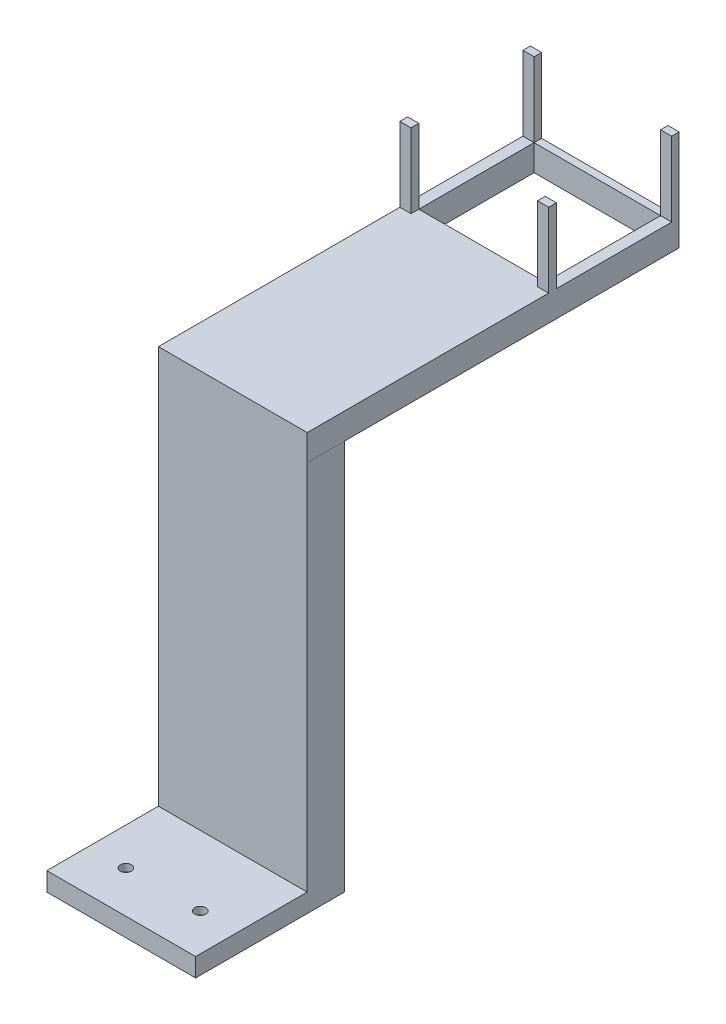
ISO-10303-21;
HEADER;
FILE_DESCRIPTION(('STEP AP214'),'2;1');
FILE_NAME('part.step','',(''),(''),'','','');
FILE_SCHEMA(('AUTOMOTIVE_DESIGN { 1 0 10303 214 1 1 1 1 }'));
ENDSEC;
DATA;
#1=APPLICATION_CONTEXT('core data for automotive mechanical design processes');
#2=APPLICATION_PROTOCOL_DEFINITION('international standard','automotive_design',2000,#1);
#3=PRODUCT_CONTEXT('',#1,'mechanical');
#4=PRODUCT('Part','Part','',(#3));
#5=PRODUCT_RELATED_PRODUCT_CATEGORY('part','',(#4));
#6=PRODUCT_DEFINITION_FORMATION('','',#4);
#7=PRODUCT_DEFINITION_CONTEXT('part definition',#1,'design');
#8=PRODUCT_DEFINITION('design','',#6,#7);
#9=PRODUCT_DEFINITION_SHAPE('','',#8);
#10=(LENGTH_UNIT() NAMED_UNIT(*) SI_UNIT(.MILLI.,.METRE.));
#11=(NAMED_UNIT(*) PLANE_ANGLE_UNIT() SI_UNIT($,.RADIAN.));
#12=(NAMED_UNIT(*) SI_UNIT($,.STERADIAN.) SOLID_ANGLE_UNIT());
#13=UNCERTAINTY_MEASURE_WITH_UNIT(LENGTH_MEASURE(1.E-05),#10,'distance_accuracy_value','');
#14=(GEOMETRIC_REPRESENTATION_CONTEXT(3) GLOBAL_UNCERTAINTY_ASSIGNED_CONTEXT((#13)) GLOBAL_UNIT_ASSIGNED_CONTEXT((#10,
#11,#12)) REPRESENTATION_CONTEXT('',''));
#15=CARTESIAN_POINT('',(0.,0.,0.));
#16=DIRECTION('',(0.,0.,1.));
#17=DIRECTION('',(1.,0.,0.));
#18=AXIS2_PLACEMENT_3D('',#15,#16,#17);
#19=CARTESIAN_POINT('',(0.,112.,0.));
#20=DIRECTION('',(0.,-1.,0.));
#21=DIRECTION('',(0.,0.,-1.));
#22=AXIS2_PLACEMENT_3D('',#19,#20,#21);
#23=PLANE('',#22);
#24=DIRECTION('',(1.,0.,0.));
#25=VECTOR('',#24,1.);
#26=CARTESIAN_POINT('',(37.0017229121583,112.,-94.9067704623263));
#27=LINE('',#26,#25);
#28=CARTESIAN_POINT('',(37.0017229121583,112.,-94.9067704623263));
#29=VERTEX_POINT('',#28);
#30=CARTESIAN_POINT('',(40.0034458243166,112.,-94.9067704623263));
#31=VERTEX_POINT('',#30);
#32=EDGE_CURVE('E58',#29,#31,#27,.T.);
#33=ORIENTED_EDGE('',*,*,#32,.F.);
#34=DIRECTION('',(0.,0.,1.));
#35=VECTOR('',#34,1.);
#36=CARTESIAN_POINT('',(37.0017229121583,112.,-97.));
#37=LINE('',#36,#35);
#38=CARTESIAN_POINT('',(37.0017229121583,112.,-97.));
#39=VERTEX_POINT('',#38);
#40=EDGE_CURVE('E250',#39,#29,#37,.T.);
#41=ORIENTED_EDGE('',*,*,#40,.F.);
#42=DIRECTION('',(1.,0.,0.));
#43=VECTOR('',#42,1.);
#44=CARTESIAN_POINT('',(3.00172291215829,112.,-97.));
#45=LINE('',#44,#43);
#46=CARTESIAN_POINT('',(3.00172291215829,112.,-97.));
#47=VERTEX_POINT('',#46);
#48=EDGE_CURVE('E375',#47,#39,#45,.T.);
#49=ORIENTED_EDGE('',*,*,#48,.F.);
#50=DIRECTION('',(0.,0.,-1.));
#51=VECTOR('',#50,1.);
#52=CARTESIAN_POINT('',(3.00172291215829,112.,-97.));
#53=LINE('',#52,#51);
#54=CARTESIAN_POINT('',(3.00172291215829,112.,-94.9067704623263));
#55=VERTEX_POINT('',#54);
#56=EDGE_CURVE('E291',#55,#47,#53,.T.);
#57=ORIENTED_EDGE('',*,*,#56,.F.);
#58=DIRECTION('',(1.,0.,0.));
#59=VECTOR('',#58,1.);
#60=CARTESIAN_POINT('',(3.00172291215829,112.,-94.9067704623263));
#61=LINE('',#60,#59);
#62=CARTESIAN_POINT('',(0.,112.,-94.9067704623263));
#63=VERTEX_POINT('',#62);
#64=EDGE_CURVE('E282',#63,#55,#61,.T.);
#65=ORIENTED_EDGE('',*,*,#64,.F.);
#66=DIRECTION('',(0.,0.,1.));
#67=VECTOR('',#66,1.);
#68=CARTESIAN_POINT('',(0.,112.,-30.));
#69=LINE('',#68,#67);
#70=CARTESIAN_POINT('',(0.,112.,-30.));
#71=VERTEX_POINT('',#70);
#72=EDGE_CURVE('E405',#63,#71,#69,.T.);
#73=ORIENTED_EDGE('',*,*,#72,.T.);
#74=DIRECTION('',(1.,0.,0.));
#75=VECTOR('',#74,1.);
#76=CARTESIAN_POINT('',(0.,112.,-30.));
#77=LINE('',#76,#75);
#78=CARTESIAN_POINT('',(40.0034458243166,112.,-30.));
#79=VERTEX_POINT('',#78);
#80=EDGE_CURVE('E220',#71,#79,#77,.T.);
#81=ORIENTED_EDGE('',*,*,#80,.T.);
#82=DIRECTION('',(0.,0.,-1.));
#83=VECTOR('',#82,1.);
#84=CARTESIAN_POINT('',(40.0034458243166,112.,-30.));
#85=LINE('',#84,#83);
#86=EDGE_CURVE('E63',#79,#31,#85,.T.);
#87=ORIENTED_EDGE('',*,*,#86,.T.);
#88=EDGE_LOOP('',(#33,#41,#49,#57,#65,#73,#81,#87));
#89=FACE_BOUND('',#88,.T.);
#90=ADVANCED_FACE('F42',(#89),#23,.F.);
#91=DIRECTION('',(-1.,0.,0.));
#92=VECTOR('',#91,1.);
#93=CARTESIAN_POINT('',(37.0017229121583,112.,-97.));
#94=LINE('',#93,#92);
#95=CARTESIAN_POINT('',(40.0034458243166,112.,-97.));
#96=VERTEX_POINT('',#95);
#97=EDGE_CURVE('E224',#96,#39,#94,.T.);
#98=ORIENTED_EDGE('',*,*,#97,.F.);
#99=CARTESIAN_POINT('',(40.0034458243166,112.,-128.));
#100=VERTEX_POINT('',#99);
#101=EDGE_CURVE('E207',#96,#100,#85,.T.);
#102=ORIENTED_EDGE('',*,*,#101,.T.);
#103=DIRECTION('',(1.,0.,0.));
#104=VECTOR('',#103,1.);
#105=CARTESIAN_POINT('',(37.0017229121583,112.,-128.));
#106=LINE('',#105,#104);
#107=CARTESIAN_POINT('',(37.0017229121583,112.,-128.));
#108=VERTEX_POINT('',#107);
#109=EDGE_CURVE('E346',#108,#100,#106,.T.);
#110=ORIENTED_EDGE('',*,*,#109,.F.);
#111=DIRECTION('',(0.,0.,-1.));
#112=VECTOR('',#111,1.);
#113=CARTESIAN_POINT('',(37.0017229121583,112.,-128.));
#114=LINE('',#113,#112);
#115=EDGE_CURVE('E227',#39,#108,#114,.T.);
#116=ORIENTED_EDGE('',*,*,#115,.F.);
#117=EDGE_LOOP('',(#98,#102,#110,#116));
#118=FACE_BOUND('',#117,.T.);
#119=ADVANCED_FACE('F225',(#118),#23,.F.);
#120=DIRECTION('',(-1.,0.,0.));
#121=VECTOR('',#120,1.);
#122=CARTESIAN_POINT('',(3.00172291215829,112.,-97.));
#123=LINE('',#122,#121);
#124=CARTESIAN_POINT('',(0.,112.,-97.));
#125=VERTEX_POINT('',#124);
#126=EDGE_CURVE('E286',#47,#125,#123,.T.);
#127=ORIENTED_EDGE('',*,*,#126,.F.);
#128=DIRECTION('',(0.,0.,1.));
#129=VECTOR('',#128,1.);
#130=CARTESIAN_POINT('',(3.00172291215829,112.,-128.));
#131=LINE('',#130,#129);
#132=CARTESIAN_POINT('',(3.00172291215829,112.,-128.));
#133=VERTEX_POINT('',#132);
#134=EDGE_CURVE('E371',#133,#47,#131,.T.);
#135=ORIENTED_EDGE('',*,*,#134,.F.);
#136=DIRECTION('',(1.,0.,0.));
#137=VECTOR('',#136,1.);
#138=CARTESIAN_POINT('',(3.00172291215829,112.,-128.));
#139=LINE('',#138,#137);
#140=CARTESIAN_POINT('',(0.,112.,-128.));
#141=VERTEX_POINT('',#140);
#142=EDGE_CURVE('E319',#141,#133,#139,.T.);
#143=ORIENTED_EDGE('',*,*,#142,.F.);
#144=EDGE_CURVE('E402',#141,#125,#69,.T.);
#145=ORIENTED_EDGE('',*,*,#144,.T.);
#146=EDGE_LOOP('',(#127,#135,#143,#145));
#147=FACE_BOUND('',#146,.T.);
#148=ADVANCED_FACE('F539',(#147),#23,.F.);
#149=DIRECTION('',(0.,0.,-1.));
#150=VECTOR('',#149,1.);
#151=CARTESIAN_POINT('',(3.00172291215829,112.,-128.));
#152=LINE('',#151,#150);
#153=CARTESIAN_POINT('',(3.00172291215829,112.,-130.));
#154=VERTEX_POINT('',#153);
#155=EDGE_CURVE('E323',#133,#154,#152,.T.);
#156=ORIENTED_EDGE('',*,*,#155,.F.);
#157=DIRECTION('',(-1.,0.,0.));
#158=VECTOR('',#157,1.);
#159=CARTESIAN_POINT('',(3.00172291215829,112.,-128.));
#160=LINE('',#159,#158);
#161=EDGE_CURVE('E381',#108,#133,#160,.T.);
#162=ORIENTED_EDGE('',*,*,#161,.F.);
#163=DIRECTION('',(0.,0.,1.));
#164=VECTOR('',#163,1.);
#165=CARTESIAN_POINT('',(37.0017229121583,112.,-128.));
#166=LINE('',#165,#164);
#167=CARTESIAN_POINT('',(37.0017229121583,112.,-130.));
#168=VERTEX_POINT('',#167);
#169=EDGE_CURVE('E328',#168,#108,#166,.T.);
#170=ORIENTED_EDGE('',*,*,#169,.F.);
#171=DIRECTION('',(-1.,0.,0.));
#172=VECTOR('',#171,1.);
#173=CARTESIAN_POINT('',(0.,112.,-130.));
#174=LINE('',#173,#172);
#175=EDGE_CURVE('E409',#168,#154,#174,.T.);
#176=ORIENTED_EDGE('',*,*,#175,.T.);
#177=EDGE_LOOP('',(#156,#162,#170,#176));
#178=FACE_BOUND('',#177,.T.);
#179=ADVANCED_FACE('F596',(#178),#23,.F.);
#180=CARTESIAN_POINT('',(0.,5.,0.));
#181=DIRECTION('',(0.,-1.,0.));
#182=DIRECTION('',(0.,0.,-1.));
#183=AXIS2_PLACEMENT_3D('',#180,#181,#182);
#184=PLANE('',#183);
#185=CARTESIAN_POINT('',(30.,5.,-11.2517260652819));
#186=DIRECTION('',(0.,1.,0.));
#187=DIRECTION('',(0.,0.,1.));
#188=AXIS2_PLACEMENT_3D('',#185,#186,#187);
#189=CIRCLE('',#188,1.5);
#190=CARTESIAN_POINT('',(30.,5.,-9.75172606528194));
#191=VERTEX_POINT('',#190);
#192=EDGE_CURVE('E456',#191,#191,#189,.T.);
#193=ORIENTED_EDGE('',*,*,#192,.F.);
#194=EDGE_LOOP('',(#193));
#195=FACE_BOUND('',#194,.T.);
#196=CARTESIAN_POINT('',(10.,5.,-11.2517260652819));
#197=DIRECTION('',(0.,1.,0.));
#198=DIRECTION('',(0.,0.,1.));
#199=AXIS2_PLACEMENT_3D('',#196,#197,#198);
#200=CIRCLE('',#199,1.5);
#201=CARTESIAN_POINT('',(10.,5.,-9.75172606528194));
#202=VERTEX_POINT('',#201);
#203=EDGE_CURVE('E462',#202,#202,#200,.T.);
#204=ORIENTED_EDGE('',*,*,#203,.F.);
#205=EDGE_LOOP('',(#204));
#206=FACE_BOUND('',#205,.T.);
#207=DIRECTION('',(1.,0.,0.));
#208=VECTOR('',#207,1.);
#209=CARTESIAN_POINT('',(0.,5.,-30.));
#210=LINE('',#209,#208);
#211=CARTESIAN_POINT('',(0.,5.,-30.));
#212=VERTEX_POINT('',#211);
#213=CARTESIAN_POINT('',(40.,5.,-30.));
#214=VERTEX_POINT('',#213);
#215=EDGE_CURVE('E436',#212,#214,#210,.T.);
#216=ORIENTED_EDGE('',*,*,#215,.F.);
#217=DIRECTION('',(0.,0.,1.));
#218=VECTOR('',#217,1.);
#219=CARTESIAN_POINT('',(0.,5.,0.));
#220=LINE('',#219,#218);
#221=CARTESIAN_POINT('',(0.,5.,0.));
#222=VERTEX_POINT('',#221);
#223=EDGE_CURVE('E473',#212,#222,#220,.T.);
#224=ORIENTED_EDGE('',*,*,#223,.T.);
#225=DIRECTION('',(1.,0.,0.));
#226=VECTOR('',#225,1.);
#227=CARTESIAN_POINT('',(0.,5.,0.));
#228=LINE('',#227,#226);
#229=CARTESIAN_POINT('',(40.,5.,0.));
#230=VERTEX_POINT('',#229);
#231=EDGE_CURVE('E476',#222,#230,#228,.T.);
#232=ORIENTED_EDGE('',*,*,#231,.T.);
#233=DIRECTION('',(0.,0.,-1.));
#234=VECTOR('',#233,1.);
#235=CARTESIAN_POINT('',(40.,5.,0.));
#236=LINE('',#235,#234);
#237=EDGE_CURVE('E480',#230,#214,#236,.T.);
#238=ORIENTED_EDGE('',*,*,#237,.T.);
#239=EDGE_LOOP('',(#216,#224,#232,#238));
#240=FACE_BOUND('',#239,.T.);
#241=ADVANCED_FACE('F603',(#195,#206,#240),#184,.F.);
#242=CARTESIAN_POINT('',(0.,5.,0.));
#243=DIRECTION('',(1.,0.,0.));
#244=DIRECTION('',(0.,0.,-1.));
#245=AXIS2_PLACEMENT_3D('',#242,#243,#244);
#246=PLANE('',#245);
#247=DIRECTION('',(0.,0.,1.));
#248=VECTOR('',#247,1.);
#249=CARTESIAN_POINT('',(0.,0.,0.));
#250=LINE('',#249,#248);
#251=CARTESIAN_POINT('',(0.,0.,-40.));
#252=VERTEX_POINT('',#251);
#253=CARTESIAN_POINT('',(0.,0.,0.));
#254=VERTEX_POINT('',#253);
#255=EDGE_CURVE('E461',#252,#254,#250,.T.);
#256=ORIENTED_EDGE('',*,*,#255,.T.);
#257=DIRECTION('',(0.,-1.,0.));
#258=VECTOR('',#257,1.);
#259=CARTESIAN_POINT('',(0.,5.,0.));
#260=LINE('',#259,#258);
#261=EDGE_CURVE('E506',#222,#254,#260,.T.);
#262=ORIENTED_EDGE('',*,*,#261,.F.);
#263=ORIENTED_EDGE('',*,*,#223,.F.);
#264=DIRECTION('',(0.,-1.,0.));
#265=VECTOR('',#264,1.);
#266=CARTESIAN_POINT('',(0.,105.,-30.));
#267=LINE('',#266,#265);
#268=EDGE_CURVE('E452',#71,#212,#267,.T.);
#269=ORIENTED_EDGE('',*,*,#268,.F.);
#270=ORIENTED_EDGE('',*,*,#72,.F.);
#271=DIRECTION('',(0.,-1.,0.));
#272=VECTOR('',#271,1.);
#273=CARTESIAN_POINT('',(0.,132.,-94.9067704623263));
#274=LINE('',#273,#272);
#275=CARTESIAN_POINT('',(0.,132.,-94.9067704623263));
#276=VERTEX_POINT('',#275);
#277=EDGE_CURVE('E273',#276,#63,#274,.T.);
#278=ORIENTED_EDGE('',*,*,#277,.F.);
#279=DIRECTION('',(0.,0.,1.));
#280=VECTOR('',#279,1.);
#281=CARTESIAN_POINT('',(0.,132.,-97.));
#282=LINE('',#281,#280);
#283=CARTESIAN_POINT('',(0.,132.,-97.));
#284=VERTEX_POINT('',#283);
#285=EDGE_CURVE('E298',#284,#276,#282,.T.);
#286=ORIENTED_EDGE('',*,*,#285,.F.);
#287=DIRECTION('',(0.,-1.,0.));
#288=VECTOR('',#287,1.);
#289=CARTESIAN_POINT('',(0.,132.,-97.));
#290=LINE('',#289,#288);
#291=EDGE_CURVE('E269',#284,#125,#290,.T.);
#292=ORIENTED_EDGE('',*,*,#291,.T.);
#293=ORIENTED_EDGE('',*,*,#144,.F.);
#294=DIRECTION('',(0.,-1.,0.));
#295=VECTOR('',#294,1.);
#296=CARTESIAN_POINT('',(0.,132.,-128.));
#297=LINE('',#296,#295);
#298=CARTESIAN_POINT('',(0.,132.,-128.));
#299=VERTEX_POINT('',#298);
#300=EDGE_CURVE('E310',#299,#141,#297,.T.);
#301=ORIENTED_EDGE('',*,*,#300,.F.);
#302=DIRECTION('',(0.,0.,1.));
#303=VECTOR('',#302,1.);
#304=CARTESIAN_POINT('',(0.,132.,-128.));
#305=LINE('',#304,#303);
#306=CARTESIAN_POINT('',(0.,132.,-130.));
#307=VERTEX_POINT('',#306);
#308=EDGE_CURVE('E331',#307,#299,#305,.T.);
#309=ORIENTED_EDGE('',*,*,#308,.F.);
#310=DIRECTION('',(0.,-1.,0.));
#311=VECTOR('',#310,1.);
#312=CARTESIAN_POINT('',(0.,112.,-130.));
#313=LINE('',#312,#311);
#314=CARTESIAN_POINT('',(0.,105.,-130.));
#315=VERTEX_POINT('',#314);
#316=EDGE_CURVE('E412',#307,#315,#313,.T.);
#317=ORIENTED_EDGE('',*,*,#316,.T.);
#318=DIRECTION('',(0.,0.,1.));
#319=VECTOR('',#318,1.);
#320=CARTESIAN_POINT('',(0.,105.,-30.));
#321=LINE('',#320,#319);
#322=CARTESIAN_POINT('',(0.,105.,-40.));
#323=VERTEX_POINT('',#322);
#324=EDGE_CURVE('E390',#315,#323,#321,.T.);
#325=ORIENTED_EDGE('',*,*,#324,.T.);
#326=DIRECTION('',(0.,-1.,0.));
#327=VECTOR('',#326,1.);
#328=CARTESIAN_POINT('',(0.,5.,-40.));
#329=LINE('',#328,#327);
#330=EDGE_CURVE('E483',#323,#252,#329,.T.);
#331=ORIENTED_EDGE('',*,*,#330,.T.);
#332=EDGE_LOOP('',(#256,#262,#263,#269,#270,#278,#286,#292,#293,#301,#309,#317,#325,#331));
#333=FACE_BOUND('',#332,.T.);
#334=ADVANCED_FACE('F44',(#333),#246,.F.);
#335=CARTESIAN_POINT('',(0.,5.,0.));
#336=DIRECTION('',(0.,0.,-1.));
#337=DIRECTION('',(-1.,0.,0.));
#338=AXIS2_PLACEMENT_3D('',#335,#336,#337);
#339=PLANE('',#338);
#340=DIRECTION('',(1.,0.,0.));
#341=VECTOR('',#340,1.);
#342=CARTESIAN_POINT('',(0.,0.,0.));
#343=LINE('',#342,#341);
#344=CARTESIAN_POINT('',(40.,0.,0.));
#345=VERTEX_POINT('',#344);
#346=EDGE_CURVE('E487',#254,#345,#343,.T.);
#347=ORIENTED_EDGE('',*,*,#346,.T.);
#348=DIRECTION('',(0.,-1.,0.));
#349=VECTOR('',#348,1.);
#350=CARTESIAN_POINT('',(40.,5.,0.));
#351=LINE('',#350,#349);
#352=EDGE_CURVE('E502',#230,#345,#351,.T.);
#353=ORIENTED_EDGE('',*,*,#352,.F.);
#354=ORIENTED_EDGE('',*,*,#231,.F.);
#355=ORIENTED_EDGE('',*,*,#261,.T.);
#356=EDGE_LOOP('',(#347,#353,#354,#355));
#357=FACE_BOUND('',#356,.T.);
#358=ADVANCED_FACE('F630',(#357),#339,.F.);
#359=CARTESIAN_POINT('',(40.,5.,0.));
#360=DIRECTION('',(-1.,0.,0.));
#361=DIRECTION('',(0.,0.,1.));
#362=AXIS2_PLACEMENT_3D('',#359,#360,#361);
#363=PLANE('',#362);
#364=DIRECTION('',(0.,0.,-1.));
#365=VECTOR('',#364,1.);
#366=CARTESIAN_POINT('',(40.,0.,0.));
#367=LINE('',#366,#365);
#368=CARTESIAN_POINT('',(40.,0.,-40.));
#369=VERTEX_POINT('',#368);
#370=EDGE_CURVE('E490',#345,#369,#367,.T.);
#371=ORIENTED_EDGE('',*,*,#370,.T.);
#372=DIRECTION('',(0.,-1.,0.));
#373=VECTOR('',#372,1.);
#374=CARTESIAN_POINT('',(40.,5.,-40.));
#375=LINE('',#374,#373);
#376=CARTESIAN_POINT('',(40.,105.,-40.));
#377=VERTEX_POINT('',#376);
#378=EDGE_CURVE('E498',#377,#369,#375,.T.);
#379=ORIENTED_EDGE('',*,*,#378,.F.);
#380=DIRECTION('',(0.,0.,-1.));
#381=VECTOR('',#380,1.);
#382=CARTESIAN_POINT('',(40.,105.,-40.));
#383=LINE('',#382,#381);
#384=CARTESIAN_POINT('',(40.,105.,-30.));
#385=VERTEX_POINT('',#384);
#386=EDGE_CURVE('E437',#385,#377,#383,.T.);
#387=ORIENTED_EDGE('',*,*,#386,.F.);
#388=DIRECTION('',(0.,-1.,0.));
#389=VECTOR('',#388,1.);
#390=CARTESIAN_POINT('',(40.,105.,-30.));
#391=LINE('',#390,#389);
#392=EDGE_CURVE('E445',#385,#214,#391,.T.);
#393=ORIENTED_EDGE('',*,*,#392,.T.);
#394=ORIENTED_EDGE('',*,*,#237,.F.);
#395=ORIENTED_EDGE('',*,*,#352,.T.);
#396=EDGE_LOOP('',(#371,#379,#387,#393,#394,#395));
#397=FACE_BOUND('',#396,.T.);
#398=ADVANCED_FACE('F634',(#397),#363,.F.);
#399=CARTESIAN_POINT('',(0.,5.,-40.));
#400=DIRECTION('',(0.,0.,1.));
#401=DIRECTION('',(1.,0.,0.));
#402=AXIS2_PLACEMENT_3D('',#399,#400,#401);
#403=PLANE('',#402);
#404=DIRECTION('',(-1.,0.,0.));
#405=VECTOR('',#404,1.);
#406=CARTESIAN_POINT('',(0.,0.,-40.));
#407=LINE('',#406,#405);
#408=EDGE_CURVE('E477',#369,#252,#407,.T.);
#409=ORIENTED_EDGE('',*,*,#408,.T.);
#410=ORIENTED_EDGE('',*,*,#330,.F.);
#411=DIRECTION('',(-1.,0.,0.));
#412=VECTOR('',#411,1.);
#413=CARTESIAN_POINT('',(0.,105.,-40.));
#414=LINE('',#413,#412);
#415=EDGE_CURVE('E441',#377,#323,#414,.T.);
#416=ORIENTED_EDGE('',*,*,#415,.F.);
#417=ORIENTED_EDGE('',*,*,#378,.T.);
#418=EDGE_LOOP('',(#409,#410,#416,#417));
#419=FACE_BOUND('',#418,.T.);
#420=ADVANCED_FACE('F620',(#419),#403,.F.);
#421=CARTESIAN_POINT('',(0.,0.,0.));
#422=DIRECTION('',(0.,-1.,0.));
#423=DIRECTION('',(0.,0.,-1.));
#424=AXIS2_PLACEMENT_3D('',#421,#422,#423);
#425=PLANE('',#424);
#426=ORIENTED_EDGE('',*,*,#255,.F.);
#427=ORIENTED_EDGE('',*,*,#408,.F.);
#428=ORIENTED_EDGE('',*,*,#370,.F.);
#429=ORIENTED_EDGE('',*,*,#346,.F.);
#430=EDGE_LOOP('',(#426,#427,#428,#429));
#431=FACE_BOUND('',#430,.T.);
#432=ADVANCED_FACE('F625',(#431),#425,.T.);
#433=CARTESIAN_POINT('',(30.,3.,-11.2517260652819));
#434=DIRECTION('',(0.,1.,0.));
#435=DIRECTION('',(0.,0.,1.));
#436=AXIS2_PLACEMENT_3D('',#433,#434,#435);
#437=CYLINDRICAL_SURFACE('',#436,1.5);
#438=CARTESIAN_POINT('',(30.,3.,-11.2517260652819));
#439=DIRECTION('',(0.,1.,0.));
#440=DIRECTION('',(0.,0.,1.));
#441=AXIS2_PLACEMENT_3D('',#438,#439,#440);
#442=CIRCLE('',#441,1.5);
#443=CARTESIAN_POINT('',(30.,3.,-9.75172606528194));
#444=VERTEX_POINT('',#443);
#445=EDGE_CURVE('E466',#444,#444,#442,.T.);
#446=ORIENTED_EDGE('',*,*,#445,.F.);
#447=EDGE_LOOP('',(#446));
#448=FACE_BOUND('',#447,.T.);
#449=ORIENTED_EDGE('',*,*,#192,.T.);
#450=EDGE_LOOP('',(#449));
#451=FACE_BOUND('',#450,.T.);
#452=ADVANCED_FACE('F681',(#448,#451),#437,.F.);
#453=CARTESIAN_POINT('',(0.,3.,0.));
#454=DIRECTION('',(0.,1.,0.));
#455=DIRECTION('',(0.,0.,1.));
#456=AXIS2_PLACEMENT_3D('',#453,#454,#455);
#457=PLANE('',#456);
#458=ORIENTED_EDGE('',*,*,#445,.T.);
#459=EDGE_LOOP('',(#458));
#460=FACE_BOUND('',#459,.T.);
#461=ADVANCED_FACE('F677',(#460),#457,.T.);
#462=CARTESIAN_POINT('',(10.,3.,-11.2517260652819));
#463=DIRECTION('',(0.,1.,0.));
#464=DIRECTION('',(0.,0.,1.));
#465=AXIS2_PLACEMENT_3D('',#462,#463,#464);
#466=CYLINDRICAL_SURFACE('',#465,1.5);
#467=CARTESIAN_POINT('',(10.,3.,-11.2517260652819));
#468=DIRECTION('',(0.,1.,0.));
#469=DIRECTION('',(0.,0.,1.));
#470=AXIS2_PLACEMENT_3D('',#467,#468,#469);
#471=CIRCLE('',#470,1.5);
#472=CARTESIAN_POINT('',(10.,3.,-9.75172606528194));
#473=VERTEX_POINT('',#472);
#474=EDGE_CURVE('E457',#473,#473,#471,.T.);
#475=ORIENTED_EDGE('',*,*,#474,.F.);
#476=EDGE_LOOP('',(#475));
#477=FACE_BOUND('',#476,.T.);
#478=ORIENTED_EDGE('',*,*,#203,.T.);
#479=EDGE_LOOP('',(#478));
#480=FACE_BOUND('',#479,.T.);
#481=ADVANCED_FACE('F673',(#477,#480),#466,.F.);
#482=CARTESIAN_POINT('',(0.,3.,0.));
#483=DIRECTION('',(0.,1.,0.));
#484=DIRECTION('',(0.,0.,1.));
#485=AXIS2_PLACEMENT_3D('',#482,#483,#484);
#486=PLANE('',#485);
#487=ORIENTED_EDGE('',*,*,#474,.T.);
#488=EDGE_LOOP('',(#487));
#489=FACE_BOUND('',#488,.T.);
#490=ADVANCED_FACE('F670',(#489),#486,.T.);
#491=CARTESIAN_POINT('',(0.,105.,-30.));
#492=DIRECTION('',(0.,0.,-1.));
#493=DIRECTION('',(-1.,0.,0.));
#494=AXIS2_PLACEMENT_3D('',#491,#492,#493);
#495=PLANE('',#494);
#496=ORIENTED_EDGE('',*,*,#215,.T.);
#497=ORIENTED_EDGE('',*,*,#392,.F.);
#498=DIRECTION('',(1.,0.,0.));
#499=VECTOR('',#498,1.);
#500=CARTESIAN_POINT('',(0.,105.,-30.));
#501=LINE('',#500,#499);
#502=CARTESIAN_POINT('',(40.0034458243166,105.,-30.));
#503=VERTEX_POINT('',#502);
#504=EDGE_CURVE('E416',#385,#503,#501,.T.);
#505=ORIENTED_EDGE('',*,*,#504,.T.);
#506=DIRECTION('',(0.,-1.,0.));
#507=VECTOR('',#506,1.);
#508=CARTESIAN_POINT('',(40.0034458243166,112.,-30.));
#509=LINE('',#508,#507);
#510=EDGE_CURVE('E432',#79,#503,#509,.T.);
#511=ORIENTED_EDGE('',*,*,#510,.F.);
#512=ORIENTED_EDGE('',*,*,#80,.F.);
#513=ORIENTED_EDGE('',*,*,#268,.T.);
#514=EDGE_LOOP('',(#496,#497,#505,#511,#512,#513));
#515=FACE_BOUND('',#514,.T.);
#516=ADVANCED_FACE('F574',(#515),#495,.F.);
#517=CARTESIAN_POINT('',(40.0034458243166,112.,-30.));
#518=DIRECTION('',(-1.,0.,0.));
#519=DIRECTION('',(0.,0.,1.));
#520=AXIS2_PLACEMENT_3D('',#517,#518,#519);
#521=PLANE('',#520);
#522=DIRECTION('',(0.,0.,-1.));
#523=VECTOR('',#522,1.);
#524=CARTESIAN_POINT('',(40.0034458243166,105.,-30.));
#525=LINE('',#524,#523);
#526=CARTESIAN_POINT('',(40.0034458243166,105.,-130.));
#527=VERTEX_POINT('',#526);
#528=EDGE_CURVE('E419',#503,#527,#525,.T.);
#529=ORIENTED_EDGE('',*,*,#528,.T.);
#530=DIRECTION('',(0.,-1.,0.));
#531=VECTOR('',#530,1.);
#532=CARTESIAN_POINT('',(40.0034458243166,112.,-130.));
#533=LINE('',#532,#531);
#534=CARTESIAN_POINT('',(40.0034458243166,132.,-130.));
#535=VERTEX_POINT('',#534);
#536=EDGE_CURVE('E428',#535,#527,#533,.T.);
#537=ORIENTED_EDGE('',*,*,#536,.F.);
#538=DIRECTION('',(0.,0.,-1.));
#539=VECTOR('',#538,1.);
#540=CARTESIAN_POINT('',(40.0034458243166,132.,-128.));
#541=LINE('',#540,#539);
#542=CARTESIAN_POINT('',(40.0034458243166,132.,-128.));
#543=VERTEX_POINT('',#542);
#544=EDGE_CURVE('E349',#543,#535,#541,.T.);
#545=ORIENTED_EDGE('',*,*,#544,.F.);
#546=DIRECTION('',(0.,-1.,0.));
#547=VECTOR('',#546,1.);
#548=CARTESIAN_POINT('',(40.0034458243166,132.,-128.));
#549=LINE('',#548,#547);
#550=EDGE_CURVE('E216',#543,#100,#549,.T.);
#551=ORIENTED_EDGE('',*,*,#550,.T.);
#552=ORIENTED_EDGE('',*,*,#101,.F.);
#553=DIRECTION('',(0.,-1.,0.));
#554=VECTOR('',#553,1.);
#555=CARTESIAN_POINT('',(40.0034458243166,132.,-97.));
#556=LINE('',#555,#554);
#557=CARTESIAN_POINT('',(40.0034458243166,132.,-97.));
#558=VERTEX_POINT('',#557);
#559=EDGE_CURVE('E212',#558,#96,#556,.T.);
#560=ORIENTED_EDGE('',*,*,#559,.F.);
#561=DIRECTION('',(0.,0.,-1.));
#562=VECTOR('',#561,1.);
#563=CARTESIAN_POINT('',(40.0034458243166,132.,-97.));
#564=LINE('',#563,#562);
#565=CARTESIAN_POINT('',(40.0034458243166,132.,-94.9067704623263));
#566=VERTEX_POINT('',#565);
#567=EDGE_CURVE('E257',#566,#558,#564,.T.);
#568=ORIENTED_EDGE('',*,*,#567,.F.);
#569=DIRECTION('',(0.,-1.,0.));
#570=VECTOR('',#569,1.);
#571=CARTESIAN_POINT('',(40.0034458243166,132.,-94.9067704623263));
#572=LINE('',#571,#570);
#573=EDGE_CURVE('E238',#566,#31,#572,.T.);
#574=ORIENTED_EDGE('',*,*,#573,.T.);
#575=ORIENTED_EDGE('',*,*,#86,.F.);
#576=ORIENTED_EDGE('',*,*,#510,.T.);
#577=EDGE_LOOP('',(#529,#537,#545,#551,#552,#560,#568,#574,#575,#576));
#578=FACE_BOUND('',#577,.T.);
#579=ADVANCED_FACE('F209',(#578),#521,.F.);
#580=CARTESIAN_POINT('',(0.,112.,-130.));
#581=DIRECTION('',(0.,0.,1.));
#582=DIRECTION('',(1.,0.,0.));
#583=AXIS2_PLACEMENT_3D('',#580,#581,#582);
#584=PLANE('',#583);
#585=DIRECTION('',(-1.,0.,0.));
#586=VECTOR('',#585,1.);
#587=CARTESIAN_POINT('',(0.,105.,-130.));
#588=LINE('',#587,#586);
#589=EDGE_CURVE('E422',#527,#315,#588,.T.);
#590=ORIENTED_EDGE('',*,*,#589,.T.);
#591=ORIENTED_EDGE('',*,*,#316,.F.);
#592=DIRECTION('',(-1.,0.,0.));
#593=VECTOR('',#592,1.);
#594=CARTESIAN_POINT('',(3.00172291215829,132.,-130.));
#595=LINE('',#594,#593);
#596=CARTESIAN_POINT('',(3.00172291215829,132.,-130.));
#597=VERTEX_POINT('',#596);
#598=EDGE_CURVE('E334',#597,#307,#595,.T.);
#599=ORIENTED_EDGE('',*,*,#598,.F.);
#600=DIRECTION('',(0.,-1.,0.));
#601=VECTOR('',#600,1.);
#602=CARTESIAN_POINT('',(3.00172291215829,132.,-130.));
#603=LINE('',#602,#601);
#604=EDGE_CURVE('E295',#597,#154,#603,.T.);
#605=ORIENTED_EDGE('',*,*,#604,.T.);
#606=ORIENTED_EDGE('',*,*,#175,.F.);
#607=DIRECTION('',(0.,-1.,0.));
#608=VECTOR('',#607,1.);
#609=CARTESIAN_POINT('',(37.0017229121583,132.,-130.));
#610=LINE('',#609,#608);
#611=CARTESIAN_POINT('',(37.0017229121583,132.,-130.));
#612=VERTEX_POINT('',#611);
#613=EDGE_CURVE('E356',#612,#168,#610,.T.);
#614=ORIENTED_EDGE('',*,*,#613,.F.);
#615=DIRECTION('',(-1.,0.,0.));
#616=VECTOR('',#615,1.);
#617=CARTESIAN_POINT('',(37.0017229121583,132.,-130.));
#618=LINE('',#617,#616);
#619=EDGE_CURVE('E353',#535,#612,#618,.T.);
#620=ORIENTED_EDGE('',*,*,#619,.F.);
#621=ORIENTED_EDGE('',*,*,#536,.T.);
#622=EDGE_LOOP('',(#590,#591,#599,#605,#606,#614,#620,#621));
#623=FACE_BOUND('',#622,.T.);
#624=ADVANCED_FACE('F614',(#623),#584,.F.);
#625=CARTESIAN_POINT('',(0.,105.,0.));
#626=DIRECTION('',(0.,-1.,0.));
#627=DIRECTION('',(0.,0.,-1.));
#628=AXIS2_PLACEMENT_3D('',#625,#626,#627);
#629=PLANE('',#628);
#630=DIRECTION('',(0.,0.,-1.));
#631=VECTOR('',#630,1.);
#632=CARTESIAN_POINT('',(3.00172291215829,105.,0.));
#633=LINE('',#632,#631);
#634=CARTESIAN_POINT('',(3.00172291215829,105.,-97.));
#635=VERTEX_POINT('',#634);
#636=CARTESIAN_POINT('',(3.00172291215829,105.,-128.));
#637=VERTEX_POINT('',#636);
#638=EDGE_CURVE('E11',#635,#637,#633,.T.);
#639=ORIENTED_EDGE('',*,*,#638,.F.);
#640=DIRECTION('',(-1.,0.,0.));
#641=VECTOR('',#640,1.);
#642=CARTESIAN_POINT('',(0.,105.,-97.));
#643=LINE('',#642,#641);
#644=CARTESIAN_POINT('',(37.0017229121583,105.,-97.));
#645=VERTEX_POINT('',#644);
#646=EDGE_CURVE('E510',#645,#635,#643,.T.);
#647=ORIENTED_EDGE('',*,*,#646,.F.);
#648=DIRECTION('',(0.,0.,1.));
#649=VECTOR('',#648,1.);
#650=CARTESIAN_POINT('',(37.0017229121583,105.,0.));
#651=LINE('',#650,#649);
#652=CARTESIAN_POINT('',(37.0017229121583,105.,-128.));
#653=VERTEX_POINT('',#652);
#654=EDGE_CURVE('E513',#653,#645,#651,.T.);
#655=ORIENTED_EDGE('',*,*,#654,.F.);
#656=DIRECTION('',(1.,0.,0.));
#657=VECTOR('',#656,1.);
#658=CARTESIAN_POINT('',(0.,105.,-128.));
#659=LINE('',#658,#657);
#660=EDGE_CURVE('E51',#637,#653,#659,.T.);
#661=ORIENTED_EDGE('',*,*,#660,.F.);
#662=EDGE_LOOP('',(#639,#647,#655,#661));
#663=FACE_BOUND('',#662,.T.);
#664=ORIENTED_EDGE('',*,*,#504,.F.);
#665=ORIENTED_EDGE('',*,*,#386,.T.);
#666=ORIENTED_EDGE('',*,*,#415,.T.);
#667=ORIENTED_EDGE('',*,*,#324,.F.);
#668=ORIENTED_EDGE('',*,*,#589,.F.);
#669=ORIENTED_EDGE('',*,*,#528,.F.);
#670=EDGE_LOOP('',(#664,#665,#666,#667,#668,#669));
#671=FACE_BOUND('',#670,.T.);
#672=ADVANCED_FACE('F529',(#663,#671),#629,.T.);
#673=CARTESIAN_POINT('',(3.00172291215829,12.,-128.));
#674=DIRECTION('',(-1.,0.,0.));
#675=DIRECTION('',(0.,0.,1.));
#676=AXIS2_PLACEMENT_3D('',#673,#674,#675);
#677=PLANE('',#676);
#678=ORIENTED_EDGE('',*,*,#638,.T.);
#679=DIRECTION('',(0.,1.,0.));
#680=VECTOR('',#679,1.);
#681=CARTESIAN_POINT('',(3.00172291215829,12.,-128.));
#682=LINE('',#681,#680);
#683=EDGE_CURVE('E386',#637,#133,#682,.T.);
#684=ORIENTED_EDGE('',*,*,#683,.T.);
#685=ORIENTED_EDGE('',*,*,#134,.T.);
#686=DIRECTION('',(0.,1.,0.));
#687=VECTOR('',#686,1.);
#688=CARTESIAN_POINT('',(3.00172291215829,12.,-97.));
#689=LINE('',#688,#687);
#690=EDGE_CURVE('E385',#635,#47,#689,.T.);
#691=ORIENTED_EDGE('',*,*,#690,.F.);
#692=EDGE_LOOP('',(#678,#684,#685,#691));
#693=FACE_BOUND('',#692,.T.);
#694=ADVANCED_FACE('F536',(#693),#677,.F.);
#695=CARTESIAN_POINT('',(3.00172291215829,12.,-128.));
#696=DIRECTION('',(0.,0.,-1.));
#697=DIRECTION('',(-1.,0.,0.));
#698=AXIS2_PLACEMENT_3D('',#695,#696,#697);
#699=PLANE('',#698);
#700=ORIENTED_EDGE('',*,*,#660,.T.);
#701=DIRECTION('',(0.,1.,0.));
#702=VECTOR('',#701,1.);
#703=CARTESIAN_POINT('',(37.0017229121583,12.,-128.));
#704=LINE('',#703,#702);
#705=EDGE_CURVE('E391',#653,#108,#704,.T.);
#706=ORIENTED_EDGE('',*,*,#705,.T.);
#707=ORIENTED_EDGE('',*,*,#161,.T.);
#708=ORIENTED_EDGE('',*,*,#683,.F.);
#709=EDGE_LOOP('',(#700,#706,#707,#708));
#710=FACE_BOUND('',#709,.T.);
#711=ADVANCED_FACE('F521',(#710),#699,.F.);
#712=CARTESIAN_POINT('',(37.0017229121583,12.,-128.));
#713=DIRECTION('',(1.,0.,0.));
#714=DIRECTION('',(0.,0.,-1.));
#715=AXIS2_PLACEMENT_3D('',#712,#713,#714);
#716=PLANE('',#715);
#717=ORIENTED_EDGE('',*,*,#654,.T.);
#718=DIRECTION('',(0.,1.,0.));
#719=VECTOR('',#718,1.);
#720=CARTESIAN_POINT('',(37.0017229121583,12.,-97.));
#721=LINE('',#720,#719);
#722=EDGE_CURVE('E395',#645,#39,#721,.T.);
#723=ORIENTED_EDGE('',*,*,#722,.T.);
#724=ORIENTED_EDGE('',*,*,#115,.T.);
#725=ORIENTED_EDGE('',*,*,#705,.F.);
#726=EDGE_LOOP('',(#717,#723,#724,#725));
#727=FACE_BOUND('',#726,.T.);
#728=ADVANCED_FACE('F526',(#727),#716,.F.);
#729=CARTESIAN_POINT('',(3.00172291215829,12.,-97.));
#730=DIRECTION('',(0.,0.,1.));
#731=DIRECTION('',(1.,0.,0.));
#732=AXIS2_PLACEMENT_3D('',#729,#730,#731);
#733=PLANE('',#732);
#734=ORIENTED_EDGE('',*,*,#646,.T.);
#735=ORIENTED_EDGE('',*,*,#690,.T.);
#736=ORIENTED_EDGE('',*,*,#48,.T.);
#737=ORIENTED_EDGE('',*,*,#722,.F.);
#738=EDGE_LOOP('',(#734,#735,#736,#737));
#739=FACE_BOUND('',#738,.T.);
#740=ADVANCED_FACE('F533',(#739),#733,.F.);
#741=CARTESIAN_POINT('',(37.0017229121583,132.,-128.));
#742=DIRECTION('',(1.,0.,0.));
#743=DIRECTION('',(0.,0.,-1.));
#744=AXIS2_PLACEMENT_3D('',#741,#742,#743);
#745=PLANE('',#744);
#746=ORIENTED_EDGE('',*,*,#169,.T.);
#747=DIRECTION('',(0.,-1.,0.));
#748=VECTOR('',#747,1.);
#749=CARTESIAN_POINT('',(37.0017229121583,132.,-128.));
#750=LINE('',#749,#748);
#751=CARTESIAN_POINT('',(37.0017229121583,132.,-128.));
#752=VERTEX_POINT('',#751);
#753=EDGE_CURVE('E367',#752,#108,#750,.T.);
#754=ORIENTED_EDGE('',*,*,#753,.F.);
#755=DIRECTION('',(0.,0.,1.));
#756=VECTOR('',#755,1.);
#757=CARTESIAN_POINT('',(37.0017229121583,132.,-128.));
#758=LINE('',#757,#756);
#759=EDGE_CURVE('E341',#612,#752,#758,.T.);
#760=ORIENTED_EDGE('',*,*,#759,.F.);
#761=ORIENTED_EDGE('',*,*,#613,.T.);
#762=EDGE_LOOP('',(#746,#754,#760,#761));
#763=FACE_BOUND('',#762,.T.);
#764=ADVANCED_FACE('F643',(#763),#745,.F.);
#765=CARTESIAN_POINT('',(37.0017229121583,132.,-128.));
#766=DIRECTION('',(0.,0.,-1.));
#767=DIRECTION('',(-1.,0.,0.));
#768=AXIS2_PLACEMENT_3D('',#765,#766,#767);
#769=PLANE('',#768);
#770=ORIENTED_EDGE('',*,*,#109,.T.);
#771=ORIENTED_EDGE('',*,*,#550,.F.);
#772=DIRECTION('',(1.,0.,0.));
#773=VECTOR('',#772,1.);
#774=CARTESIAN_POINT('',(37.0017229121583,132.,-128.));
#775=LINE('',#774,#773);
#776=EDGE_CURVE('E345',#752,#543,#775,.T.);
#777=ORIENTED_EDGE('',*,*,#776,.F.);
#778=ORIENTED_EDGE('',*,*,#753,.T.);
#779=EDGE_LOOP('',(#770,#771,#777,#778));
#780=FACE_BOUND('',#779,.T.);
#781=ADVANCED_FACE('F641',(#780),#769,.F.);
#782=CARTESIAN_POINT('',(0.,132.,0.));
#783=DIRECTION('',(0.,-1.,0.));
#784=DIRECTION('',(0.,0.,-1.));
#785=AXIS2_PLACEMENT_3D('',#782,#783,#784);
#786=PLANE('',#785);
#787=ORIENTED_EDGE('',*,*,#759,.T.);
#788=ORIENTED_EDGE('',*,*,#776,.T.);
#789=ORIENTED_EDGE('',*,*,#544,.T.);
#790=ORIENTED_EDGE('',*,*,#619,.T.);
#791=EDGE_LOOP('',(#787,#788,#789,#790));
#792=FACE_BOUND('',#791,.T.);
#793=ADVANCED_FACE('F638',(#792),#786,.F.);
#794=CARTESIAN_POINT('',(3.00172291215829,132.,-128.));
#795=DIRECTION('',(-1.,0.,0.));
#796=DIRECTION('',(0.,0.,1.));
#797=AXIS2_PLACEMENT_3D('',#794,#795,#796);
#798=PLANE('',#797);
#799=ORIENTED_EDGE('',*,*,#155,.T.);
#800=ORIENTED_EDGE('',*,*,#604,.F.);
#801=DIRECTION('',(0.,0.,-1.));
#802=VECTOR('',#801,1.);
#803=CARTESIAN_POINT('',(3.00172291215829,132.,-128.));
#804=LINE('',#803,#802);
#805=CARTESIAN_POINT('',(3.00172291215829,132.,-128.));
#806=VERTEX_POINT('',#805);
#807=EDGE_CURVE('E324',#806,#597,#804,.T.);
#808=ORIENTED_EDGE('',*,*,#807,.F.);
#809=DIRECTION('',(0.,-1.,0.));
#810=VECTOR('',#809,1.);
#811=CARTESIAN_POINT('',(3.00172291215829,132.,-128.));
#812=LINE('',#811,#810);
#813=EDGE_CURVE('E314',#806,#133,#812,.T.);
#814=ORIENTED_EDGE('',*,*,#813,.T.);
#815=EDGE_LOOP('',(#799,#800,#808,#814));
#816=FACE_BOUND('',#815,.T.);
#817=ADVANCED_FACE('F548',(#816),#798,.F.);
#818=CARTESIAN_POINT('',(3.00172291215829,132.,-128.));
#819=DIRECTION('',(0.,0.,-1.));
#820=DIRECTION('',(-1.,0.,0.));
#821=AXIS2_PLACEMENT_3D('',#818,#819,#820);
#822=PLANE('',#821);
#823=ORIENTED_EDGE('',*,*,#142,.T.);
#824=ORIENTED_EDGE('',*,*,#813,.F.);
#825=DIRECTION('',(1.,0.,0.));
#826=VECTOR('',#825,1.);
#827=CARTESIAN_POINT('',(3.00172291215829,132.,-128.));
#828=LINE('',#827,#826);
#829=EDGE_CURVE('E318',#299,#806,#828,.T.);
#830=ORIENTED_EDGE('',*,*,#829,.F.);
#831=ORIENTED_EDGE('',*,*,#300,.T.);
#832=EDGE_LOOP('',(#823,#824,#830,#831));
#833=FACE_BOUND('',#832,.T.);
#834=ADVANCED_FACE('F543',(#833),#822,.F.);
#835=CARTESIAN_POINT('',(0.,132.,0.));
#836=DIRECTION('',(0.,1.,0.));
#837=DIRECTION('',(0.,0.,1.));
#838=AXIS2_PLACEMENT_3D('',#835,#836,#837);
#839=PLANE('',#838);
#840=ORIENTED_EDGE('',*,*,#807,.T.);
#841=ORIENTED_EDGE('',*,*,#598,.T.);
#842=ORIENTED_EDGE('',*,*,#308,.T.);
#843=ORIENTED_EDGE('',*,*,#829,.T.);
#844=EDGE_LOOP('',(#840,#841,#842,#843));
#845=FACE_BOUND('',#844,.T.);
#846=ADVANCED_FACE('F551',(#845),#839,.T.);
#847=CARTESIAN_POINT('',(3.00172291215829,132.,-97.));
#848=DIRECTION('',(-1.,0.,0.));
#849=DIRECTION('',(0.,0.,1.));
#850=AXIS2_PLACEMENT_3D('',#847,#848,#849);
#851=PLANE('',#850);
#852=ORIENTED_EDGE('',*,*,#56,.T.);
#853=DIRECTION('',(0.,-1.,0.));
#854=VECTOR('',#853,1.);
#855=CARTESIAN_POINT('',(3.00172291215829,132.,-97.));
#856=LINE('',#855,#854);
#857=CARTESIAN_POINT('',(3.00172291215829,132.,-97.));
#858=VERTEX_POINT('',#857);
#859=EDGE_CURVE('E254',#858,#47,#856,.T.);
#860=ORIENTED_EDGE('',*,*,#859,.F.);
#861=DIRECTION('',(0.,0.,-1.));
#862=VECTOR('',#861,1.);
#863=CARTESIAN_POINT('',(3.00172291215829,132.,-97.));
#864=LINE('',#863,#862);
#865=CARTESIAN_POINT('',(3.00172291215829,132.,-94.9067704623263));
#866=VERTEX_POINT('',#865);
#867=EDGE_CURVE('E287',#866,#858,#864,.T.);
#868=ORIENTED_EDGE('',*,*,#867,.F.);
#869=DIRECTION('',(0.,-1.,0.));
#870=VECTOR('',#869,1.);
#871=CARTESIAN_POINT('',(3.00172291215829,132.,-94.9067704623263));
#872=LINE('',#871,#870);
#873=EDGE_CURVE('E277',#866,#55,#872,.T.);
#874=ORIENTED_EDGE('',*,*,#873,.T.);
#875=EDGE_LOOP('',(#852,#860,#868,#874));
#876=FACE_BOUND('',#875,.T.);
#877=ADVANCED_FACE('F561',(#876),#851,.F.);
#878=CARTESIAN_POINT('',(3.00172291215829,132.,-97.));
#879=DIRECTION('',(0.,0.,1.));
#880=DIRECTION('',(1.,0.,0.));
#881=AXIS2_PLACEMENT_3D('',#878,#879,#880);
#882=PLANE('',#881);
#883=ORIENTED_EDGE('',*,*,#126,.T.);
#884=ORIENTED_EDGE('',*,*,#291,.F.);
#885=DIRECTION('',(-1.,0.,0.));
#886=VECTOR('',#885,1.);
#887=CARTESIAN_POINT('',(3.00172291215829,132.,-97.));
#888=LINE('',#887,#886);
#889=EDGE_CURVE('E301',#858,#284,#888,.T.);
#890=ORIENTED_EDGE('',*,*,#889,.F.);
#891=ORIENTED_EDGE('',*,*,#859,.T.);
#892=EDGE_LOOP('',(#883,#884,#890,#891));
#893=FACE_BOUND('',#892,.T.);
#894=ADVANCED_FACE('F557',(#893),#882,.F.);
#895=CARTESIAN_POINT('',(3.00172291215829,132.,-94.9067704623263));
#896=DIRECTION('',(0.,0.,-1.));
#897=DIRECTION('',(-1.,0.,0.));
#898=AXIS2_PLACEMENT_3D('',#895,#896,#897);
#899=PLANE('',#898);
#900=ORIENTED_EDGE('',*,*,#64,.T.);
#901=ORIENTED_EDGE('',*,*,#873,.F.);
#902=DIRECTION('',(1.,0.,0.));
#903=VECTOR('',#902,1.);
#904=CARTESIAN_POINT('',(3.00172291215829,132.,-94.9067704623263));
#905=LINE('',#904,#903);
#906=EDGE_CURVE('E281',#276,#866,#905,.T.);
#907=ORIENTED_EDGE('',*,*,#906,.F.);
#908=ORIENTED_EDGE('',*,*,#277,.T.);
#909=EDGE_LOOP('',(#900,#901,#907,#908));
#910=FACE_BOUND('',#909,.T.);
#911=ADVANCED_FACE('F565',(#910),#899,.F.);
#912=CARTESIAN_POINT('',(0.,132.,0.));
#913=DIRECTION('',(0.,-1.,0.));
#914=DIRECTION('',(0.,0.,-1.));
#915=AXIS2_PLACEMENT_3D('',#912,#913,#914);
#916=PLANE('',#915);
#917=ORIENTED_EDGE('',*,*,#867,.T.);
#918=ORIENTED_EDGE('',*,*,#889,.T.);
#919=ORIENTED_EDGE('',*,*,#285,.T.);
#920=ORIENTED_EDGE('',*,*,#906,.T.);
#921=EDGE_LOOP('',(#917,#918,#919,#920));
#922=FACE_BOUND('',#921,.T.);
#923=ADVANCED_FACE('F961',(#922),#916,.F.);
#924=CARTESIAN_POINT('',(37.0017229121583,132.,-97.));
#925=DIRECTION('',(1.,0.,0.));
#926=DIRECTION('',(0.,0.,-1.));
#927=AXIS2_PLACEMENT_3D('',#924,#925,#926);
#928=PLANE('',#927);
#929=ORIENTED_EDGE('',*,*,#40,.T.);
#930=DIRECTION('',(0.,-1.,0.));
#931=VECTOR('',#930,1.);
#932=CARTESIAN_POINT('',(37.0017229121583,132.,-94.9067704623263));
#933=LINE('',#932,#931);
#934=CARTESIAN_POINT('',(37.0017229121583,132.,-94.9067704623263));
#935=VERTEX_POINT('',#934);
#936=EDGE_CURVE('E244',#935,#29,#933,.T.);
#937=ORIENTED_EDGE('',*,*,#936,.F.);
#938=DIRECTION('',(0.,0.,1.));
#939=VECTOR('',#938,1.);
#940=CARTESIAN_POINT('',(37.0017229121583,132.,-97.));
#941=LINE('',#940,#939);
#942=CARTESIAN_POINT('',(37.0017229121583,132.,-97.));
#943=VERTEX_POINT('',#942);
#944=EDGE_CURVE('E232',#943,#935,#941,.T.);
#945=ORIENTED_EDGE('',*,*,#944,.F.);
#946=DIRECTION('',(0.,-1.,0.));
#947=VECTOR('',#946,1.);
#948=CARTESIAN_POINT('',(37.0017229121583,132.,-97.));
#949=LINE('',#948,#947);
#950=EDGE_CURVE('E237',#943,#39,#949,.T.);
#951=ORIENTED_EDGE('',*,*,#950,.T.);
#952=EDGE_LOOP('',(#929,#937,#945,#951));
#953=FACE_BOUND('',#952,.T.);
#954=ADVANCED_FACE('F584',(#953),#928,.F.);
#955=CARTESIAN_POINT('',(37.0017229121583,132.,-94.9067704623263));
#956=DIRECTION('',(0.,0.,-1.));
#957=DIRECTION('',(-1.,0.,0.));
#958=AXIS2_PLACEMENT_3D('',#955,#956,#957);
#959=PLANE('',#958);
#960=ORIENTED_EDGE('',*,*,#32,.T.);
#961=ORIENTED_EDGE('',*,*,#573,.F.);
#962=DIRECTION('',(1.,0.,0.));
#963=VECTOR('',#962,1.);
#964=CARTESIAN_POINT('',(37.0017229121583,132.,-94.9067704623263));
#965=LINE('',#964,#963);
#966=EDGE_CURVE('E260',#935,#566,#965,.T.);
#967=ORIENTED_EDGE('',*,*,#966,.F.);
#968=ORIENTED_EDGE('',*,*,#936,.T.);
#969=EDGE_LOOP('',(#960,#961,#967,#968));
#970=FACE_BOUND('',#969,.T.);
#971=ADVANCED_FACE('F579',(#970),#959,.F.);
#972=CARTESIAN_POINT('',(37.0017229121583,132.,-97.));
#973=DIRECTION('',(0.,0.,1.));
#974=DIRECTION('',(1.,0.,0.));
#975=AXIS2_PLACEMENT_3D('',#972,#973,#974);
#976=PLANE('',#975);
#977=ORIENTED_EDGE('',*,*,#97,.T.);
#978=ORIENTED_EDGE('',*,*,#950,.F.);
#979=DIRECTION('',(-1.,0.,0.));
#980=VECTOR('',#979,1.);
#981=CARTESIAN_POINT('',(37.0017229121583,132.,-97.));
#982=LINE('',#981,#980);
#983=EDGE_CURVE('E235',#558,#943,#982,.T.);
#984=ORIENTED_EDGE('',*,*,#983,.F.);
#985=ORIENTED_EDGE('',*,*,#559,.T.);
#986=EDGE_LOOP('',(#977,#978,#984,#985));
#987=FACE_BOUND('',#986,.T.);
#988=ADVANCED_FACE('F234',(#987),#976,.F.);
#989=CARTESIAN_POINT('',(0.,132.,0.));
#990=DIRECTION('',(0.,1.,0.));
#991=DIRECTION('',(0.,0.,1.));
#992=AXIS2_PLACEMENT_3D('',#989,#990,#991);
#993=PLANE('',#992);
#994=ORIENTED_EDGE('',*,*,#944,.T.);
#995=ORIENTED_EDGE('',*,*,#966,.T.);
#996=ORIENTED_EDGE('',*,*,#567,.T.);
#997=ORIENTED_EDGE('',*,*,#983,.T.);
#998=EDGE_LOOP('',(#994,#995,#996,#997));
#999=FACE_BOUND('',#998,.T.);
#1000=ADVANCED_FACE('F586',(#999),#993,.T.);
#1001=CLOSED_SHELL('',(#90,#119,#148,#179,#241,#334,#358,#398,#420,#432,#452,#461,#481,#490,
#516,#579,#624,#672,#694,#711,#728,#740,#764,#781,#793,#817,#834,#846,#877,#894,#911,#923,#954,
#971,#988,#1000));
#1002=MANIFOLD_SOLID_BREP('B2',#1001);
#1003=ADVANCED_BREP_SHAPE_REPRESENTATION('',(#18,#1002),#14);
#1004=SHAPE_DEFINITION_REPRESENTATION(#9,#1003);
ENDSEC;
END-ISO-10303-21;
